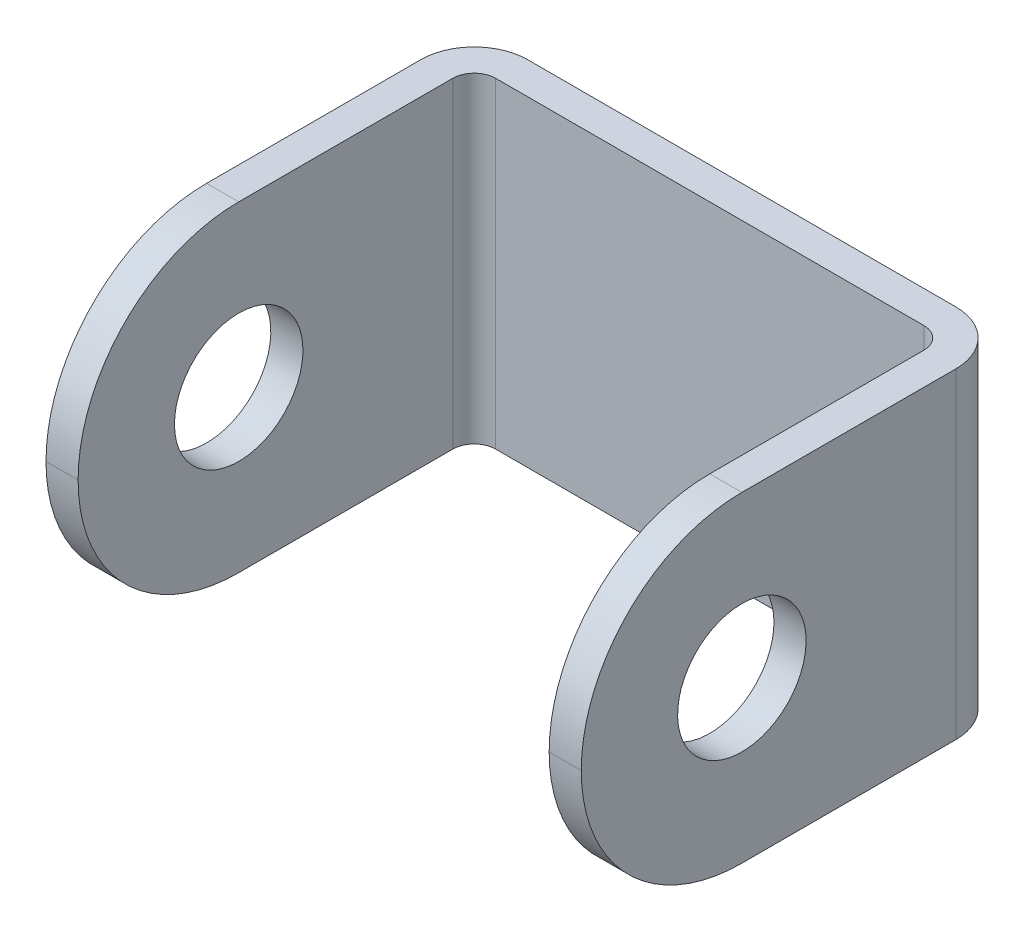
ISO-10303-21;
HEADER;
FILE_DESCRIPTION(('STEP AP214'),'2;1');
FILE_NAME('part.step','',(''),(''),'','','');
FILE_SCHEMA(('AUTOMOTIVE_DESIGN { 1 0 10303 214 1 1 1 1 }'));
ENDSEC;
DATA;
#1=APPLICATION_CONTEXT('core data for automotive mechanical design processes');
#2=APPLICATION_PROTOCOL_DEFINITION('international standard','automotive_design',2000,#1);
#3=PRODUCT_CONTEXT('',#1,'mechanical');
#4=PRODUCT('Part','Part','',(#3));
#5=PRODUCT_RELATED_PRODUCT_CATEGORY('part','',(#4));
#6=PRODUCT_DEFINITION_FORMATION('','',#4);
#7=PRODUCT_DEFINITION_CONTEXT('part definition',#1,'design');
#8=PRODUCT_DEFINITION('design','',#6,#7);
#9=PRODUCT_DEFINITION_SHAPE('','',#8);
#10=(LENGTH_UNIT() NAMED_UNIT(*) SI_UNIT(.MILLI.,.METRE.));
#11=(NAMED_UNIT(*) PLANE_ANGLE_UNIT() SI_UNIT($,.RADIAN.));
#12=(NAMED_UNIT(*) SI_UNIT($,.STERADIAN.) SOLID_ANGLE_UNIT());
#13=UNCERTAINTY_MEASURE_WITH_UNIT(LENGTH_MEASURE(1.E-05),#10,'distance_accuracy_value','');
#14=(GEOMETRIC_REPRESENTATION_CONTEXT(3) GLOBAL_UNCERTAINTY_ASSIGNED_CONTEXT((#13)) GLOBAL_UNIT_ASSIGNED_CONTEXT((#10,
#11,#12)) REPRESENTATION_CONTEXT('',''));
#15=CARTESIAN_POINT('',(0.,0.,0.));
#16=DIRECTION('',(0.,0.,1.));
#17=DIRECTION('',(1.,0.,0.));
#18=AXIS2_PLACEMENT_3D('',#15,#16,#17);
#19=CARTESIAN_POINT('',(0.,0.,25.));
#20=DIRECTION('',(1.,0.,0.));
#21=DIRECTION('',(0.,1.,0.));
#22=AXIS2_PLACEMENT_3D('',#19,#20,#21);
#23=CYLINDRICAL_SURFACE('',#22,15.);
#24=CARTESIAN_POINT('',(-22.,0.,25.));
#25=DIRECTION('',(-1.,0.,0.));
#26=DIRECTION('',(0.,0.,1.));
#27=AXIS2_PLACEMENT_3D('',#24,#25,#26);
#28=CIRCLE('',#27,15.);
#29=CARTESIAN_POINT('',(-22.,15.,25.));
#30=VERTEX_POINT('',#29);
#31=CARTESIAN_POINT('',(-22.,0.,40.));
#32=VERTEX_POINT('',#31);
#33=EDGE_CURVE('E158',#30,#32,#28,.F.);
#34=ORIENTED_EDGE('',*,*,#33,.F.);
#35=DIRECTION('',(-1.,0.,0.));
#36=VECTOR('',#35,1.);
#37=CARTESIAN_POINT('',(25.,15.,25.));
#38=LINE('',#37,#36);
#39=CARTESIAN_POINT('',(-25.,15.,25.));
#40=VERTEX_POINT('',#39);
#41=EDGE_CURVE('E180',#40,#30,#38,.F.);
#42=ORIENTED_EDGE('',*,*,#41,.F.);
#43=CARTESIAN_POINT('',(-25.,0.,25.));
#44=DIRECTION('',(1.,0.,0.));
#45=DIRECTION('',(0.,1.,0.));
#46=AXIS2_PLACEMENT_3D('',#43,#44,#45);
#47=CIRCLE('',#46,15.);
#48=CARTESIAN_POINT('',(-25.,0.,40.));
#49=VERTEX_POINT('',#48);
#50=EDGE_CURVE('E172',#49,#40,#47,.F.);
#51=ORIENTED_EDGE('',*,*,#50,.F.);
#52=DIRECTION('',(-1.,0.,0.));
#53=VECTOR('',#52,1.);
#54=CARTESIAN_POINT('',(-25.,0.,40.));
#55=LINE('',#54,#53);
#56=EDGE_CURVE('E187',#32,#49,#55,.T.);
#57=ORIENTED_EDGE('',*,*,#56,.F.);
#58=EDGE_LOOP('',(#34,#42,#51,#57));
#59=FACE_BOUND('',#58,.T.);
#60=ADVANCED_FACE('F35',(#59),#23,.T.);
#61=CARTESIAN_POINT('',(0.,0.,25.));
#62=DIRECTION('',(-1.,0.,0.));
#63=DIRECTION('',(0.,-1.,0.));
#64=AXIS2_PLACEMENT_3D('',#61,#62,#63);
#65=CYLINDRICAL_SURFACE('',#64,15.);
#66=CARTESIAN_POINT('',(-22.,0.,25.));
#67=DIRECTION('',(-1.,0.,0.));
#68=DIRECTION('',(0.,0.,1.));
#69=AXIS2_PLACEMENT_3D('',#66,#67,#68);
#70=CIRCLE('',#69,15.);
#71=CARTESIAN_POINT('',(-22.,-15.,25.));
#72=VERTEX_POINT('',#71);
#73=EDGE_CURVE('E155',#32,#72,#70,.F.);
#74=ORIENTED_EDGE('',*,*,#73,.F.);
#75=ORIENTED_EDGE('',*,*,#56,.T.);
#76=CARTESIAN_POINT('',(-25.,0.,25.));
#77=DIRECTION('',(1.,0.,0.));
#78=DIRECTION('',(0.,1.,0.));
#79=AXIS2_PLACEMENT_3D('',#76,#77,#78);
#80=CIRCLE('',#79,15.);
#81=CARTESIAN_POINT('',(-25.,-15.,25.));
#82=VERTEX_POINT('',#81);
#83=EDGE_CURVE('E166',#82,#49,#80,.F.);
#84=ORIENTED_EDGE('',*,*,#83,.F.);
#85=DIRECTION('',(1.,0.,0.));
#86=VECTOR('',#85,1.);
#87=CARTESIAN_POINT('',(-25.,-15.,25.));
#88=LINE('',#87,#86);
#89=EDGE_CURVE('E143',#72,#82,#88,.F.);
#90=ORIENTED_EDGE('',*,*,#89,.F.);
#91=EDGE_LOOP('',(#74,#75,#84,#90));
#92=FACE_BOUND('',#91,.T.);
#93=ADVANCED_FACE('F164',(#92),#65,.T.);
#94=CARTESIAN_POINT('',(-25.,15.,40.));
#95=DIRECTION('',(1.,0.,0.));
#96=DIRECTION('',(0.,1.,0.));
#97=AXIS2_PLACEMENT_3D('',#94,#95,#96);
#98=PLANE('',#97);
#99=CARTESIAN_POINT('',(-25.,0.,25.));
#100=DIRECTION('',(1.,0.,0.));
#101=DIRECTION('',(0.,1.,0.));
#102=AXIS2_PLACEMENT_3D('',#99,#100,#101);
#103=CIRCLE('',#102,6.);
#104=CARTESIAN_POINT('',(-25.,6.,25.));
#105=VERTEX_POINT('',#104);
#106=EDGE_CURVE('E327',#105,#105,#103,.T.);
#107=ORIENTED_EDGE('',*,*,#106,.T.);
#108=EDGE_LOOP('',(#107));
#109=FACE_BOUND('',#108,.T.);
#110=DIRECTION('',(0.,0.,-1.));
#111=VECTOR('',#110,1.);
#112=CARTESIAN_POINT('',(-25.,15.,40.));
#113=LINE('',#112,#111);
#114=CARTESIAN_POINT('',(-25.,15.,5.));
#115=VERTEX_POINT('',#114);
#116=EDGE_CURVE('E237',#40,#115,#113,.T.);
#117=ORIENTED_EDGE('',*,*,#116,.T.);
#118=DIRECTION('',(0.,-1.,0.));
#119=VECTOR('',#118,1.);
#120=CARTESIAN_POINT('',(-25.,15.,5.));
#121=LINE('',#120,#119);
#122=CARTESIAN_POINT('',(-25.,-15.,5.));
#123=VERTEX_POINT('',#122);
#124=EDGE_CURVE('E11',#115,#123,#121,.T.);
#125=ORIENTED_EDGE('',*,*,#124,.T.);
#126=DIRECTION('',(0.,0.,-1.));
#127=VECTOR('',#126,1.);
#128=CARTESIAN_POINT('',(-25.,-15.,40.));
#129=LINE('',#128,#127);
#130=EDGE_CURVE('E227',#82,#123,#129,.T.);
#131=ORIENTED_EDGE('',*,*,#130,.F.);
#132=ORIENTED_EDGE('',*,*,#83,.T.);
#133=ORIENTED_EDGE('',*,*,#50,.T.);
#134=EDGE_LOOP('',(#117,#125,#131,#132,#133));
#135=FACE_BOUND('',#134,.T.);
#136=ADVANCED_FACE('F283',(#109,#135),#98,.F.);
#137=CARTESIAN_POINT('',(-25.,-15.,40.));
#138=DIRECTION('',(0.,1.,0.));
#139=DIRECTION('',(-1.,0.,0.));
#140=AXIS2_PLACEMENT_3D('',#137,#138,#139);
#141=PLANE('',#140);
#142=DIRECTION('',(1.,0.,0.));
#143=VECTOR('',#142,1.);
#144=CARTESIAN_POINT('',(-25.,-15.,0.));
#145=LINE('',#144,#143);
#146=CARTESIAN_POINT('',(-20.,-15.,0.));
#147=VERTEX_POINT('',#146);
#148=CARTESIAN_POINT('',(20.,-15.,0.));
#149=VERTEX_POINT('',#148);
#150=EDGE_CURVE('E186',#147,#149,#145,.T.);
#151=ORIENTED_EDGE('',*,*,#150,.T.);
#152=CARTESIAN_POINT('',(20.,-15.,5.));
#153=DIRECTION('',(0.,1.,0.));
#154=DIRECTION('',(-1.,0.,0.));
#155=AXIS2_PLACEMENT_3D('',#152,#153,#154);
#156=CIRCLE('',#155,5.);
#157=CARTESIAN_POINT('',(25.,-15.,5.));
#158=VERTEX_POINT('',#157);
#159=EDGE_CURVE('E44',#149,#158,#156,.F.);
#160=ORIENTED_EDGE('',*,*,#159,.T.);
#161=DIRECTION('',(0.,0.,-1.));
#162=VECTOR('',#161,1.);
#163=CARTESIAN_POINT('',(25.,-15.,40.));
#164=LINE('',#163,#162);
#165=CARTESIAN_POINT('',(25.,-15.,25.));
#166=VERTEX_POINT('',#165);
#167=EDGE_CURVE('E218',#166,#158,#164,.T.);
#168=ORIENTED_EDGE('',*,*,#167,.F.);
#169=CARTESIAN_POINT('',(22.,-15.,25.));
#170=VERTEX_POINT('',#169);
#171=EDGE_CURVE('E168',#166,#170,#88,.F.);
#172=ORIENTED_EDGE('',*,*,#171,.T.);
#173=DIRECTION('',(0.,0.,-1.));
#174=VECTOR('',#173,1.);
#175=CARTESIAN_POINT('',(22.,-15.,53.));
#176=LINE('',#175,#174);
#177=CARTESIAN_POINT('',(22.,-15.,4.99999999999999));
#178=VERTEX_POINT('',#177);
#179=EDGE_CURVE('E151',#170,#178,#176,.T.);
#180=ORIENTED_EDGE('',*,*,#179,.T.);
#181=CARTESIAN_POINT('',(20.,-15.,4.99999999999999));
#182=DIRECTION('',(0.,1.,0.));
#183=DIRECTION('',(-1.,0.,0.));
#184=AXIS2_PLACEMENT_3D('',#181,#182,#183);
#185=CIRCLE('',#184,2.);
#186=CARTESIAN_POINT('',(20.,-15.,2.99999999999999));
#187=VERTEX_POINT('',#186);
#188=EDGE_CURVE('E199',#178,#187,#185,.T.);
#189=ORIENTED_EDGE('',*,*,#188,.T.);
#190=DIRECTION('',(-1.,0.,0.));
#191=VECTOR('',#190,1.);
#192=CARTESIAN_POINT('',(-22.,-15.,3.));
#193=LINE('',#192,#191);
#194=CARTESIAN_POINT('',(-20.,-15.,3.));
#195=VERTEX_POINT('',#194);
#196=EDGE_CURVE('E259',#187,#195,#193,.T.);
#197=ORIENTED_EDGE('',*,*,#196,.T.);
#198=CARTESIAN_POINT('',(-20.,-15.,5.));
#199=DIRECTION('',(0.,1.,0.));
#200=DIRECTION('',(-1.,0.,0.));
#201=AXIS2_PLACEMENT_3D('',#198,#199,#200);
#202=CIRCLE('',#201,2.);
#203=CARTESIAN_POINT('',(-22.,-15.,5.));
#204=VERTEX_POINT('',#203);
#205=EDGE_CURVE('E147',#195,#204,#202,.T.);
#206=ORIENTED_EDGE('',*,*,#205,.T.);
#207=DIRECTION('',(0.,0.,1.));
#208=VECTOR('',#207,1.);
#209=CARTESIAN_POINT('',(-22.,-15.,53.));
#210=LINE('',#209,#208);
#211=EDGE_CURVE('E138',#204,#72,#210,.T.);
#212=ORIENTED_EDGE('',*,*,#211,.T.);
#213=ORIENTED_EDGE('',*,*,#89,.T.);
#214=ORIENTED_EDGE('',*,*,#130,.T.);
#215=CARTESIAN_POINT('',(-20.,-15.,5.));
#216=DIRECTION('',(0.,1.,0.));
#217=DIRECTION('',(-1.,0.,0.));
#218=AXIS2_PLACEMENT_3D('',#215,#216,#217);
#219=CIRCLE('',#218,5.);
#220=EDGE_CURVE('E51',#123,#147,#219,.F.);
#221=ORIENTED_EDGE('',*,*,#220,.T.);
#222=EDGE_LOOP('',(#151,#160,#168,#172,#180,#189,#197,#206,#212,#213,#214,#221));
#223=FACE_BOUND('',#222,.T.);
#224=ADVANCED_FACE('F140',(#223),#141,.F.);
#225=CARTESIAN_POINT('',(25.,15.,40.));
#226=DIRECTION('',(-1.,0.,0.));
#227=DIRECTION('',(0.,-1.,0.));
#228=AXIS2_PLACEMENT_3D('',#225,#226,#227);
#229=PLANE('',#228);
#230=CARTESIAN_POINT('',(25.,0.,25.));
#231=DIRECTION('',(1.,0.,0.));
#232=DIRECTION('',(0.,1.,0.));
#233=AXIS2_PLACEMENT_3D('',#230,#231,#232);
#234=CIRCLE('',#233,6.);
#235=CARTESIAN_POINT('',(25.,6.00000000000001,25.));
#236=VERTEX_POINT('',#235);
#237=EDGE_CURVE('E329',#236,#236,#234,.T.);
#238=ORIENTED_EDGE('',*,*,#237,.F.);
#239=EDGE_LOOP('',(#238));
#240=FACE_BOUND('',#239,.T.);
#241=ORIENTED_EDGE('',*,*,#167,.T.);
#242=DIRECTION('',(0.,1.,0.));
#243=VECTOR('',#242,1.);
#244=CARTESIAN_POINT('',(25.,15.,5.));
#245=LINE('',#244,#243);
#246=CARTESIAN_POINT('',(25.,15.,5.));
#247=VERTEX_POINT('',#246);
#248=EDGE_CURVE('E204',#158,#247,#245,.T.);
#249=ORIENTED_EDGE('',*,*,#248,.T.);
#250=DIRECTION('',(0.,0.,-1.));
#251=VECTOR('',#250,1.);
#252=CARTESIAN_POINT('',(25.,15.,40.));
#253=LINE('',#252,#251);
#254=CARTESIAN_POINT('',(25.,15.,25.));
#255=VERTEX_POINT('',#254);
#256=EDGE_CURVE('E228',#255,#247,#253,.T.);
#257=ORIENTED_EDGE('',*,*,#256,.F.);
#258=CARTESIAN_POINT('',(25.,0.,25.));
#259=DIRECTION('',(-1.,0.,0.));
#260=DIRECTION('',(0.,-1.,0.));
#261=AXIS2_PLACEMENT_3D('',#258,#259,#260);
#262=CIRCLE('',#261,15.);
#263=CARTESIAN_POINT('',(25.,0.,40.));
#264=VERTEX_POINT('',#263);
#265=EDGE_CURVE('E173',#255,#264,#262,.F.);
#266=ORIENTED_EDGE('',*,*,#265,.T.);
#267=CARTESIAN_POINT('',(25.,0.,25.));
#268=DIRECTION('',(-1.,0.,0.));
#269=DIRECTION('',(0.,-1.,0.));
#270=AXIS2_PLACEMENT_3D('',#267,#268,#269);
#271=CIRCLE('',#270,15.);
#272=EDGE_CURVE('E169',#264,#166,#271,.F.);
#273=ORIENTED_EDGE('',*,*,#272,.T.);
#274=EDGE_LOOP('',(#241,#249,#257,#266,#273));
#275=FACE_BOUND('',#274,.T.);
#276=ADVANCED_FACE('F223',(#240,#275),#229,.F.);
#277=CARTESIAN_POINT('',(-25.,15.,40.));
#278=DIRECTION('',(0.,-1.,0.));
#279=DIRECTION('',(1.,0.,0.));
#280=AXIS2_PLACEMENT_3D('',#277,#278,#279);
#281=PLANE('',#280);
#282=ORIENTED_EDGE('',*,*,#256,.T.);
#283=CARTESIAN_POINT('',(20.,15.,5.));
#284=DIRECTION('',(0.,-1.,0.));
#285=DIRECTION('',(1.,0.,0.));
#286=AXIS2_PLACEMENT_3D('',#283,#284,#285);
#287=CIRCLE('',#286,5.);
#288=CARTESIAN_POINT('',(20.,15.,0.));
#289=VERTEX_POINT('',#288);
#290=EDGE_CURVE('E209',#247,#289,#287,.F.);
#291=ORIENTED_EDGE('',*,*,#290,.T.);
#292=DIRECTION('',(-1.,0.,0.));
#293=VECTOR('',#292,1.);
#294=CARTESIAN_POINT('',(-25.,15.,0.));
#295=LINE('',#294,#293);
#296=CARTESIAN_POINT('',(-20.,15.,0.));
#297=VERTEX_POINT('',#296);
#298=EDGE_CURVE('E234',#289,#297,#295,.T.);
#299=ORIENTED_EDGE('',*,*,#298,.T.);
#300=CARTESIAN_POINT('',(-20.,15.,5.));
#301=DIRECTION('',(0.,-1.,0.));
#302=DIRECTION('',(1.,0.,0.));
#303=AXIS2_PLACEMENT_3D('',#300,#301,#302);
#304=CIRCLE('',#303,5.);
#305=EDGE_CURVE('E207',#297,#115,#304,.F.);
#306=ORIENTED_EDGE('',*,*,#305,.T.);
#307=ORIENTED_EDGE('',*,*,#116,.F.);
#308=ORIENTED_EDGE('',*,*,#41,.T.);
#309=DIRECTION('',(0.,0.,1.));
#310=VECTOR('',#309,1.);
#311=CARTESIAN_POINT('',(-22.,15.,53.));
#312=LINE('',#311,#310);
#313=CARTESIAN_POINT('',(-22.,15.,5.));
#314=VERTEX_POINT('',#313);
#315=EDGE_CURVE('E275',#314,#30,#312,.T.);
#316=ORIENTED_EDGE('',*,*,#315,.F.);
#317=CARTESIAN_POINT('',(-20.,15.,5.));
#318=DIRECTION('',(0.,-1.,0.));
#319=DIRECTION('',(1.,0.,0.));
#320=AXIS2_PLACEMENT_3D('',#317,#318,#319);
#321=CIRCLE('',#320,2.);
#322=CARTESIAN_POINT('',(-20.,15.,3.));
#323=VERTEX_POINT('',#322);
#324=EDGE_CURVE('E201',#314,#323,#321,.T.);
#325=ORIENTED_EDGE('',*,*,#324,.T.);
#326=DIRECTION('',(-1.,0.,0.));
#327=VECTOR('',#326,1.);
#328=CARTESIAN_POINT('',(-22.,15.,3.));
#329=LINE('',#328,#327);
#330=CARTESIAN_POINT('',(20.,15.,2.99999999999999));
#331=VERTEX_POINT('',#330);
#332=EDGE_CURVE('E152',#331,#323,#329,.T.);
#333=ORIENTED_EDGE('',*,*,#332,.F.);
#334=CARTESIAN_POINT('',(20.,15.,4.99999999999999));
#335=DIRECTION('',(0.,-1.,0.));
#336=DIRECTION('',(1.,0.,0.));
#337=AXIS2_PLACEMENT_3D('',#334,#335,#336);
#338=CIRCLE('',#337,2.);
#339=CARTESIAN_POINT('',(22.,15.,4.99999999999999));
#340=VERTEX_POINT('',#339);
#341=EDGE_CURVE('E197',#331,#340,#338,.T.);
#342=ORIENTED_EDGE('',*,*,#341,.T.);
#343=DIRECTION('',(0.,0.,-1.));
#344=VECTOR('',#343,1.);
#345=CARTESIAN_POINT('',(22.,15.,53.));
#346=LINE('',#345,#344);
#347=CARTESIAN_POINT('',(22.,15.,25.));
#348=VERTEX_POINT('',#347);
#349=EDGE_CURVE('E273',#348,#340,#346,.T.);
#350=ORIENTED_EDGE('',*,*,#349,.F.);
#351=EDGE_CURVE('E179',#348,#255,#38,.F.);
#352=ORIENTED_EDGE('',*,*,#351,.T.);
#353=EDGE_LOOP('',(#282,#291,#299,#306,#307,#308,#316,#325,#333,#342,#350,#352));
#354=FACE_BOUND('',#353,.T.);
#355=ADVANCED_FACE('F233',(#354),#281,.F.);
#356=CARTESIAN_POINT('',(0.,0.,0.));
#357=DIRECTION('',(0.,0.,1.));
#358=DIRECTION('',(1.,0.,0.));
#359=AXIS2_PLACEMENT_3D('',#356,#357,#358);
#360=PLANE('',#359);
#361=ORIENTED_EDGE('',*,*,#298,.F.);
#362=DIRECTION('',(0.,1.,0.));
#363=VECTOR('',#362,1.);
#364=CARTESIAN_POINT('',(20.,0.,0.));
#365=LINE('',#364,#363);
#366=EDGE_CURVE('E58',#289,#149,#365,.F.);
#367=ORIENTED_EDGE('',*,*,#366,.T.);
#368=ORIENTED_EDGE('',*,*,#150,.F.);
#369=DIRECTION('',(0.,-1.,0.));
#370=VECTOR('',#369,1.);
#371=CARTESIAN_POINT('',(-20.,0.,0.));
#372=LINE('',#371,#370);
#373=EDGE_CURVE('E211',#147,#297,#372,.F.);
#374=ORIENTED_EDGE('',*,*,#373,.T.);
#375=EDGE_LOOP('',(#361,#367,#368,#374));
#376=FACE_BOUND('',#375,.T.);
#377=ADVANCED_FACE('F236',(#376),#360,.F.);
#378=CARTESIAN_POINT('',(22.,0.,25.));
#379=DIRECTION('',(1.,0.,0.));
#380=DIRECTION('',(0.,0.,-1.));
#381=AXIS2_PLACEMENT_3D('',#378,#379,#380);
#382=CIRCLE('',#381,15.);
#383=CARTESIAN_POINT('',(22.,0.,40.));
#384=VERTEX_POINT('',#383);
#385=EDGE_CURVE('E251',#384,#348,#382,.F.);
#386=ORIENTED_EDGE('',*,*,#385,.F.);
#387=EDGE_CURVE('E183',#264,#384,#55,.T.);
#388=ORIENTED_EDGE('',*,*,#387,.F.);
#389=ORIENTED_EDGE('',*,*,#265,.F.);
#390=ORIENTED_EDGE('',*,*,#351,.F.);
#391=EDGE_LOOP('',(#386,#388,#389,#390));
#392=FACE_BOUND('',#391,.T.);
#393=ADVANCED_FACE('F250',(#392),#23,.T.);
#394=CARTESIAN_POINT('',(22.,0.,25.));
#395=DIRECTION('',(1.,0.,0.));
#396=DIRECTION('',(0.,0.,-1.));
#397=AXIS2_PLACEMENT_3D('',#394,#395,#396);
#398=CIRCLE('',#397,15.);
#399=EDGE_CURVE('E162',#170,#384,#398,.F.);
#400=ORIENTED_EDGE('',*,*,#399,.F.);
#401=ORIENTED_EDGE('',*,*,#171,.F.);
#402=ORIENTED_EDGE('',*,*,#272,.F.);
#403=ORIENTED_EDGE('',*,*,#387,.T.);
#404=EDGE_LOOP('',(#400,#401,#402,#403));
#405=FACE_BOUND('',#404,.T.);
#406=ADVANCED_FACE('F254',(#405),#65,.T.);
#407=CARTESIAN_POINT('',(-22.,-15.,53.));
#408=DIRECTION('',(-1.,0.,0.));
#409=DIRECTION('',(0.,0.,1.));
#410=AXIS2_PLACEMENT_3D('',#407,#408,#409);
#411=PLANE('',#410);
#412=CARTESIAN_POINT('',(-22.,0.,25.));
#413=DIRECTION('',(-1.,0.,0.));
#414=DIRECTION('',(0.,0.,1.));
#415=AXIS2_PLACEMENT_3D('',#412,#413,#414);
#416=CIRCLE('',#415,6.);
#417=CARTESIAN_POINT('',(-22.,0.,31.));
#418=VERTEX_POINT('',#417);
#419=EDGE_CURVE('E332',#418,#418,#416,.T.);
#420=ORIENTED_EDGE('',*,*,#419,.T.);
#421=EDGE_LOOP('',(#420));
#422=FACE_BOUND('',#421,.T.);
#423=ORIENTED_EDGE('',*,*,#211,.F.);
#424=DIRECTION('',(0.,1.,0.));
#425=VECTOR('',#424,1.);
#426=CARTESIAN_POINT('',(-22.,15.,5.));
#427=LINE('',#426,#425);
#428=EDGE_CURVE('E195',#204,#314,#427,.T.);
#429=ORIENTED_EDGE('',*,*,#428,.T.);
#430=ORIENTED_EDGE('',*,*,#315,.T.);
#431=ORIENTED_EDGE('',*,*,#33,.T.);
#432=ORIENTED_EDGE('',*,*,#73,.T.);
#433=EDGE_LOOP('',(#423,#429,#430,#431,#432));
#434=FACE_BOUND('',#433,.T.);
#435=ADVANCED_FACE('F156',(#422,#434),#411,.F.);
#436=CARTESIAN_POINT('',(-22.,-15.,3.));
#437=DIRECTION('',(0.,0.,-1.));
#438=DIRECTION('',(-1.,0.,0.));
#439=AXIS2_PLACEMENT_3D('',#436,#437,#438);
#440=PLANE('',#439);
#441=ORIENTED_EDGE('',*,*,#196,.F.);
#442=DIRECTION('',(0.,1.,0.));
#443=VECTOR('',#442,1.);
#444=CARTESIAN_POINT('',(20.,15.,2.99999999999999));
#445=LINE('',#444,#443);
#446=EDGE_CURVE('E190',#187,#331,#445,.T.);
#447=ORIENTED_EDGE('',*,*,#446,.T.);
#448=ORIENTED_EDGE('',*,*,#332,.T.);
#449=DIRECTION('',(0.,1.,0.));
#450=VECTOR('',#449,1.);
#451=CARTESIAN_POINT('',(-20.,-15.,3.));
#452=LINE('',#451,#450);
#453=EDGE_CURVE('E161',#323,#195,#452,.F.);
#454=ORIENTED_EDGE('',*,*,#453,.T.);
#455=EDGE_LOOP('',(#441,#447,#448,#454));
#456=FACE_BOUND('',#455,.T.);
#457=ADVANCED_FACE('F268',(#456),#440,.F.);
#458=CARTESIAN_POINT('',(22.,-15.,53.));
#459=DIRECTION('',(1.,0.,0.));
#460=DIRECTION('',(0.,0.,-1.));
#461=AXIS2_PLACEMENT_3D('',#458,#459,#460);
#462=PLANE('',#461);
#463=CARTESIAN_POINT('',(22.,0.,25.));
#464=DIRECTION('',(1.,0.,0.));
#465=DIRECTION('',(0.,0.,-1.));
#466=AXIS2_PLACEMENT_3D('',#463,#464,#465);
#467=CIRCLE('',#466,6.);
#468=CARTESIAN_POINT('',(22.,0.,19.));
#469=VERTEX_POINT('',#468);
#470=EDGE_CURVE('E39',#469,#469,#467,.T.);
#471=ORIENTED_EDGE('',*,*,#470,.T.);
#472=EDGE_LOOP('',(#471));
#473=FACE_BOUND('',#472,.T.);
#474=ORIENTED_EDGE('',*,*,#349,.T.);
#475=DIRECTION('',(0.,1.,0.));
#476=VECTOR('',#475,1.);
#477=CARTESIAN_POINT('',(22.,-15.,4.99999999999999));
#478=LINE('',#477,#476);
#479=EDGE_CURVE('E193',#340,#178,#478,.F.);
#480=ORIENTED_EDGE('',*,*,#479,.T.);
#481=ORIENTED_EDGE('',*,*,#179,.F.);
#482=ORIENTED_EDGE('',*,*,#399,.T.);
#483=ORIENTED_EDGE('',*,*,#385,.T.);
#484=EDGE_LOOP('',(#474,#480,#481,#482,#483));
#485=FACE_BOUND('',#484,.T.);
#486=ADVANCED_FACE('F343',(#473,#485),#462,.F.);
#487=CARTESIAN_POINT('',(20.,-15.,4.99999999999999));
#488=DIRECTION('',(0.,-1.,0.));
#489=DIRECTION('',(0.,0.,-1.));
#490=AXIS2_PLACEMENT_3D('',#487,#488,#489);
#491=CYLINDRICAL_SURFACE('',#490,2.);
#492=ORIENTED_EDGE('',*,*,#188,.F.);
#493=ORIENTED_EDGE('',*,*,#479,.F.);
#494=ORIENTED_EDGE('',*,*,#341,.F.);
#495=ORIENTED_EDGE('',*,*,#446,.F.);
#496=EDGE_LOOP('',(#492,#493,#494,#495));
#497=FACE_BOUND('',#496,.T.);
#498=ADVANCED_FACE('F264',(#497),#491,.F.);
#499=CARTESIAN_POINT('',(-20.,-15.,5.));
#500=DIRECTION('',(0.,-1.,0.));
#501=DIRECTION('',(0.,0.,-1.));
#502=AXIS2_PLACEMENT_3D('',#499,#500,#501);
#503=CYLINDRICAL_SURFACE('',#502,2.);
#504=ORIENTED_EDGE('',*,*,#205,.F.);
#505=ORIENTED_EDGE('',*,*,#453,.F.);
#506=ORIENTED_EDGE('',*,*,#324,.F.);
#507=ORIENTED_EDGE('',*,*,#428,.F.);
#508=EDGE_LOOP('',(#504,#505,#506,#507));
#509=FACE_BOUND('',#508,.T.);
#510=ADVANCED_FACE('F295',(#509),#503,.F.);
#511=CARTESIAN_POINT('',(20.,15.,5.));
#512=DIRECTION('',(0.,1.,0.));
#513=DIRECTION('',(-1.,0.,0.));
#514=AXIS2_PLACEMENT_3D('',#511,#512,#513);
#515=CYLINDRICAL_SURFACE('',#514,5.);
#516=ORIENTED_EDGE('',*,*,#159,.F.);
#517=ORIENTED_EDGE('',*,*,#366,.F.);
#518=ORIENTED_EDGE('',*,*,#290,.F.);
#519=ORIENTED_EDGE('',*,*,#248,.F.);
#520=EDGE_LOOP('',(#516,#517,#518,#519));
#521=FACE_BOUND('',#520,.T.);
#522=ADVANCED_FACE('F230',(#521),#515,.T.);
#523=CARTESIAN_POINT('',(-20.,15.,5.));
#524=DIRECTION('',(0.,-1.,0.));
#525=DIRECTION('',(1.,0.,0.));
#526=AXIS2_PLACEMENT_3D('',#523,#524,#525);
#527=CYLINDRICAL_SURFACE('',#526,5.);
#528=ORIENTED_EDGE('',*,*,#305,.F.);
#529=ORIENTED_EDGE('',*,*,#373,.F.);
#530=ORIENTED_EDGE('',*,*,#220,.F.);
#531=ORIENTED_EDGE('',*,*,#124,.F.);
#532=EDGE_LOOP('',(#528,#529,#530,#531));
#533=FACE_BOUND('',#532,.T.);
#534=ADVANCED_FACE('F37',(#533),#527,.T.);
#535=CARTESIAN_POINT('',(-25.,0.,25.));
#536=DIRECTION('',(1.,0.,0.));
#537=DIRECTION('',(0.,1.,0.));
#538=AXIS2_PLACEMENT_3D('',#535,#536,#537);
#539=CYLINDRICAL_SURFACE('',#538,6.);
#540=ORIENTED_EDGE('',*,*,#237,.T.);
#541=EDGE_LOOP('',(#540));
#542=FACE_BOUND('',#541,.T.);
#543=ORIENTED_EDGE('',*,*,#470,.F.);
#544=EDGE_LOOP('',(#543));
#545=FACE_BOUND('',#544,.T.);
#546=ADVANCED_FACE('F287',(#542,#545),#539,.F.);
#547=ORIENTED_EDGE('',*,*,#106,.F.);
#548=EDGE_LOOP('',(#547));
#549=FACE_BOUND('',#548,.T.);
#550=ORIENTED_EDGE('',*,*,#419,.F.);
#551=EDGE_LOOP('',(#550));
#552=FACE_BOUND('',#551,.T.);
#553=ADVANCED_FACE('F292',(#549,#552),#539,.F.);
#554=CLOSED_SHELL('',(#60,#93,#136,#224,#276,#355,#377,#393,#406,#435,#457,#486,#498,#510,#522,
#534,#546,#553));
#555=MANIFOLD_SOLID_BREP('B2',#554);
#556=ADVANCED_BREP_SHAPE_REPRESENTATION('',(#18,#555),#14);
#557=SHAPE_DEFINITION_REPRESENTATION(#9,#556);
ENDSEC;
END-ISO-10303-21;
